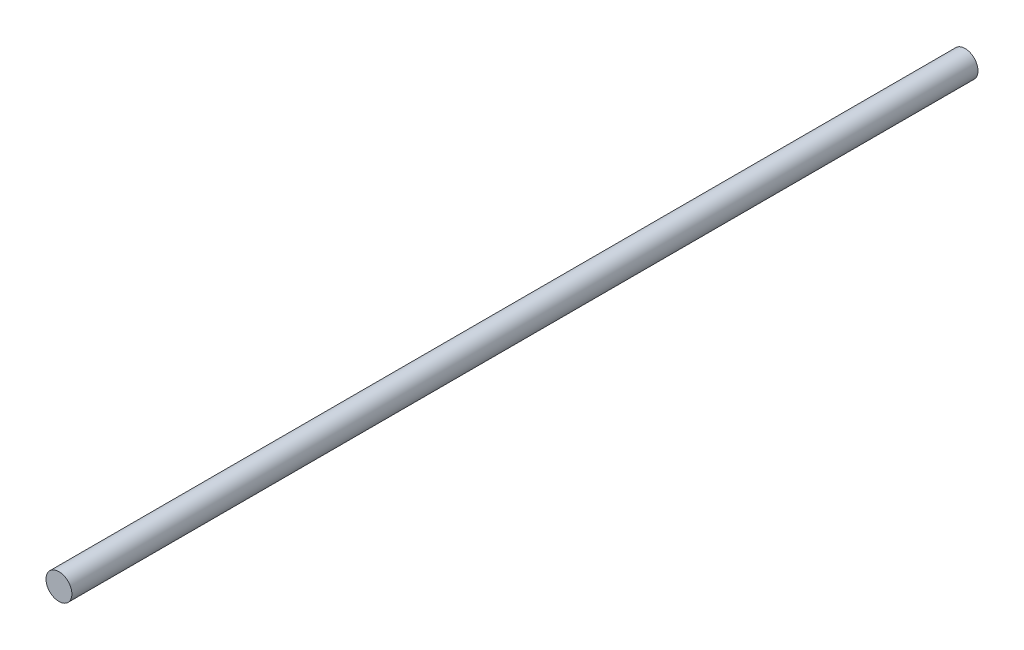
ISO-10303-21;
HEADER;
FILE_DESCRIPTION(('STEP AP214'),'2;1');
FILE_NAME('part.step','',(''),(''),'','','');
FILE_SCHEMA(('AUTOMOTIVE_DESIGN { 1 0 10303 214 1 1 1 1 }'));
ENDSEC;
DATA;
#1=APPLICATION_CONTEXT('core data for automotive mechanical design processes');
#2=APPLICATION_PROTOCOL_DEFINITION('international standard','automotive_design',2000,#1);
#3=PRODUCT_CONTEXT('',#1,'mechanical');
#4=PRODUCT('Part','Part','',(#3));
#5=PRODUCT_RELATED_PRODUCT_CATEGORY('part','',(#4));
#6=PRODUCT_DEFINITION_FORMATION('','',#4);
#7=PRODUCT_DEFINITION_CONTEXT('part definition',#1,'design');
#8=PRODUCT_DEFINITION('design','',#6,#7);
#9=PRODUCT_DEFINITION_SHAPE('','',#8);
#10=(LENGTH_UNIT() NAMED_UNIT(*) SI_UNIT(.MILLI.,.METRE.));
#11=(NAMED_UNIT(*) PLANE_ANGLE_UNIT() SI_UNIT($,.RADIAN.));
#12=(NAMED_UNIT(*) SI_UNIT($,.STERADIAN.) SOLID_ANGLE_UNIT());
#13=UNCERTAINTY_MEASURE_WITH_UNIT(LENGTH_MEASURE(1.E-05),#10,'distance_accuracy_value','');
#14=(GEOMETRIC_REPRESENTATION_CONTEXT(3) GLOBAL_UNCERTAINTY_ASSIGNED_CONTEXT((#13)) GLOBAL_UNIT_ASSIGNED_CONTEXT((#10,
#11,#12)) REPRESENTATION_CONTEXT('',''));
#15=CARTESIAN_POINT('',(0.,0.,0.));
#16=DIRECTION('',(0.,0.,1.));
#17=DIRECTION('',(1.,0.,0.));
#18=AXIS2_PLACEMENT_3D('',#15,#16,#17);
#19=CARTESIAN_POINT('',(0.,0.,105.));
#20=DIRECTION('',(0.,0.,-1.));
#21=DIRECTION('',(-1.,0.,0.));
#22=AXIS2_PLACEMENT_3D('',#19,#20,#21);
#23=CYLINDRICAL_SURFACE('',#22,1.5);
#24=CARTESIAN_POINT('',(0.,0.,105.));
#25=DIRECTION('',(0.,0.,1.));
#26=DIRECTION('',(1.,0.,0.));
#27=AXIS2_PLACEMENT_3D('',#24,#25,#26);
#28=CIRCLE('',#27,1.5);
#29=CARTESIAN_POINT('',(1.5,0.,105.));
#30=VERTEX_POINT('',#29);
#31=EDGE_CURVE('E10',#30,#30,#28,.T.);
#32=ORIENTED_EDGE('',*,*,#31,.F.);
#33=EDGE_LOOP('',(#32));
#34=FACE_BOUND('',#33,.T.);
#35=CARTESIAN_POINT('',(0.,0.,0.));
#36=DIRECTION('',(0.,0.,1.));
#37=DIRECTION('',(1.,0.,0.));
#38=AXIS2_PLACEMENT_3D('',#35,#36,#37);
#39=CIRCLE('',#38,1.5);
#40=CARTESIAN_POINT('',(1.5,0.,0.));
#41=VERTEX_POINT('',#40);
#42=EDGE_CURVE('E34',#41,#41,#39,.T.);
#43=ORIENTED_EDGE('',*,*,#42,.T.);
#44=EDGE_LOOP('',(#43));
#45=FACE_BOUND('',#44,.T.);
#46=ADVANCED_FACE('F31',(#34,#45),#23,.T.);
#47=CARTESIAN_POINT('',(0.,0.,105.));
#48=DIRECTION('',(0.,0.,1.));
#49=DIRECTION('',(1.,0.,0.));
#50=AXIS2_PLACEMENT_3D('',#47,#48,#49);
#51=PLANE('',#50);
#52=ORIENTED_EDGE('',*,*,#31,.T.);
#53=EDGE_LOOP('',(#52));
#54=FACE_BOUND('',#53,.T.);
#55=ADVANCED_FACE('F46',(#54),#51,.T.);
#56=CARTESIAN_POINT('',(0.,0.,0.));
#57=DIRECTION('',(0.,0.,1.));
#58=DIRECTION('',(1.,0.,0.));
#59=AXIS2_PLACEMENT_3D('',#56,#57,#58);
#60=PLANE('',#59);
#61=ORIENTED_EDGE('',*,*,#42,.F.);
#62=EDGE_LOOP('',(#61));
#63=FACE_BOUND('',#62,.T.);
#64=ADVANCED_FACE('F44',(#63),#60,.F.);
#65=CLOSED_SHELL('',(#46,#55,#64));
#66=MANIFOLD_SOLID_BREP('B2',#65);
#67=ADVANCED_BREP_SHAPE_REPRESENTATION('',(#18,#66),#14);
#68=SHAPE_DEFINITION_REPRESENTATION(#9,#67);
ENDSEC;
END-ISO-10303-21;
